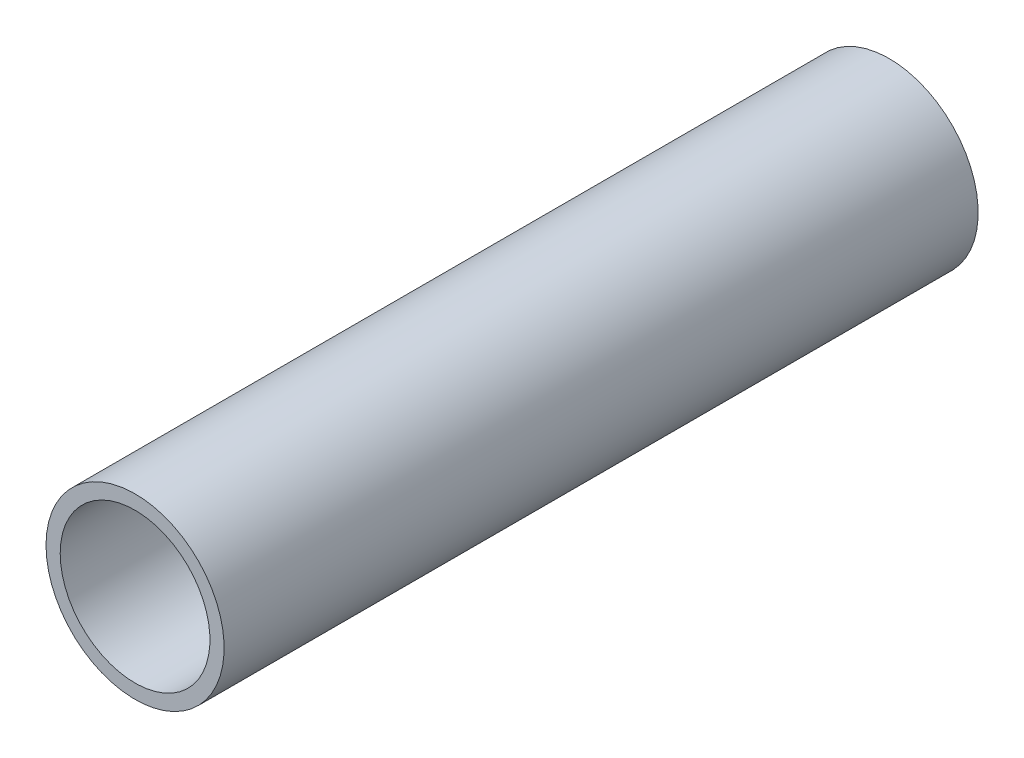
ISO-10303-21;
HEADER;
FILE_DESCRIPTION(('STEP AP214'),'2;1');
FILE_NAME('part.step','',(''),(''),'','','');
FILE_SCHEMA(('AUTOMOTIVE_DESIGN { 1 0 10303 214 1 1 1 1 }'));
ENDSEC;
DATA;
#1=APPLICATION_CONTEXT('core data for automotive mechanical design processes');
#2=APPLICATION_PROTOCOL_DEFINITION('international standard','automotive_design',2000,#1);
#3=PRODUCT_CONTEXT('',#1,'mechanical');
#4=PRODUCT('Part','Part','',(#3));
#5=PRODUCT_RELATED_PRODUCT_CATEGORY('part','',(#4));
#6=PRODUCT_DEFINITION_FORMATION('','',#4);
#7=PRODUCT_DEFINITION_CONTEXT('part definition',#1,'design');
#8=PRODUCT_DEFINITION('design','',#6,#7);
#9=PRODUCT_DEFINITION_SHAPE('','',#8);
#10=(LENGTH_UNIT() NAMED_UNIT(*) SI_UNIT(.MILLI.,.METRE.));
#11=(NAMED_UNIT(*) PLANE_ANGLE_UNIT() SI_UNIT($,.RADIAN.));
#12=(NAMED_UNIT(*) SI_UNIT($,.STERADIAN.) SOLID_ANGLE_UNIT());
#13=UNCERTAINTY_MEASURE_WITH_UNIT(LENGTH_MEASURE(1.E-05),#10,'distance_accuracy_value','');
#14=(GEOMETRIC_REPRESENTATION_CONTEXT(3) GLOBAL_UNCERTAINTY_ASSIGNED_CONTEXT((#13)) GLOBAL_UNIT_ASSIGNED_CONTEXT((#10,
#11,#12)) REPRESENTATION_CONTEXT('',''));
#15=CARTESIAN_POINT('',(0.,0.,0.));
#16=DIRECTION('',(0.,0.,1.));
#17=DIRECTION('',(1.,0.,0.));
#18=AXIS2_PLACEMENT_3D('',#15,#16,#17);
#19=CARTESIAN_POINT('',(0.,0.,40.48125));
#20=DIRECTION('',(0.,0.,-1.));
#21=DIRECTION('',(-1.,0.,0.));
#22=AXIS2_PLACEMENT_3D('',#19,#20,#21);
#23=CYLINDRICAL_SURFACE('',#22,8.0391);
#24=CARTESIAN_POINT('',(0.,0.,-40.48125));
#25=DIRECTION('',(0.,0.,-1.));
#26=DIRECTION('',(-1.,0.,0.));
#27=AXIS2_PLACEMENT_3D('',#24,#25,#26);
#28=CIRCLE('',#27,8.0391);
#29=CARTESIAN_POINT('',(-8.0391,0.,-40.48125));
#30=VERTEX_POINT('',#29);
#31=EDGE_CURVE('E26',#30,#30,#28,.T.);
#32=ORIENTED_EDGE('',*,*,#31,.T.);
#33=EDGE_LOOP('',(#32));
#34=FACE_BOUND('',#33,.T.);
#35=CARTESIAN_POINT('',(0.,0.,40.48125));
#36=DIRECTION('',(0.,0.,-1.));
#37=DIRECTION('',(-1.,0.,0.));
#38=AXIS2_PLACEMENT_3D('',#35,#36,#37);
#39=CIRCLE('',#38,8.0391);
#40=CARTESIAN_POINT('',(-8.0391,0.,40.48125));
#41=VERTEX_POINT('',#40);
#42=EDGE_CURVE('E17',#41,#41,#39,.T.);
#43=ORIENTED_EDGE('',*,*,#42,.F.);
#44=EDGE_LOOP('',(#43));
#45=FACE_BOUND('',#44,.T.);
#46=ADVANCED_FACE('F14',(#34,#45),#23,.F.);
#47=CARTESIAN_POINT('',(0.,0.,40.48125));
#48=DIRECTION('',(0.,0.,1.));
#49=DIRECTION('',(1.,0.,0.));
#50=AXIS2_PLACEMENT_3D('',#47,#48,#49);
#51=PLANE('',#50);
#52=ORIENTED_EDGE('',*,*,#42,.T.);
#53=EDGE_LOOP('',(#52));
#54=FACE_BOUND('',#53,.T.);
#55=CARTESIAN_POINT('',(0.,0.,40.48125));
#56=DIRECTION('',(0.,0.,-1.));
#57=DIRECTION('',(-1.,0.,0.));
#58=AXIS2_PLACEMENT_3D('',#55,#56,#57);
#59=CIRCLE('',#58,9.5631);
#60=CARTESIAN_POINT('',(-9.5631,0.,40.48125));
#61=VERTEX_POINT('',#60);
#62=EDGE_CURVE('E21',#61,#61,#59,.T.);
#63=ORIENTED_EDGE('',*,*,#62,.F.);
#64=EDGE_LOOP('',(#63));
#65=FACE_BOUND('',#64,.T.);
#66=ADVANCED_FACE('F34',(#54,#65),#51,.T.);
#67=CARTESIAN_POINT('',(0.,0.,-40.48125));
#68=DIRECTION('',(0.,0.,1.));
#69=DIRECTION('',(1.,0.,0.));
#70=AXIS2_PLACEMENT_3D('',#67,#68,#69);
#71=PLANE('',#70);
#72=ORIENTED_EDGE('',*,*,#31,.F.);
#73=EDGE_LOOP('',(#72));
#74=FACE_BOUND('',#73,.T.);
#75=CARTESIAN_POINT('',(0.,0.,-40.48125));
#76=DIRECTION('',(0.,0.,-1.));
#77=DIRECTION('',(-1.,0.,0.));
#78=AXIS2_PLACEMENT_3D('',#75,#76,#77);
#79=CIRCLE('',#78,9.5631);
#80=CARTESIAN_POINT('',(-9.5631,0.,-40.48125));
#81=VERTEX_POINT('',#80);
#82=EDGE_CURVE('E10',#81,#81,#79,.F.);
#83=ORIENTED_EDGE('',*,*,#82,.F.);
#84=EDGE_LOOP('',(#83));
#85=FACE_BOUND('',#84,.T.);
#86=ADVANCED_FACE('F42',(#74,#85),#71,.F.);
#87=CARTESIAN_POINT('',(0.,0.,40.48125));
#88=DIRECTION('',(0.,0.,-1.));
#89=DIRECTION('',(-1.,0.,0.));
#90=AXIS2_PLACEMENT_3D('',#87,#88,#89);
#91=CYLINDRICAL_SURFACE('',#90,9.5631);
#92=ORIENTED_EDGE('',*,*,#82,.T.);
#93=EDGE_LOOP('',(#92));
#94=FACE_BOUND('',#93,.T.);
#95=ORIENTED_EDGE('',*,*,#62,.T.);
#96=EDGE_LOOP('',(#95));
#97=FACE_BOUND('',#96,.T.);
#98=ADVANCED_FACE('F43',(#94,#97),#91,.T.);
#99=CLOSED_SHELL('',(#46,#66,#86,#98));
#100=MANIFOLD_SOLID_BREP('B1',#99);
#101=ADVANCED_BREP_SHAPE_REPRESENTATION('',(#18,#100),#14);
#102=SHAPE_DEFINITION_REPRESENTATION(#9,#101);
ENDSEC;
END-ISO-10303-21;
